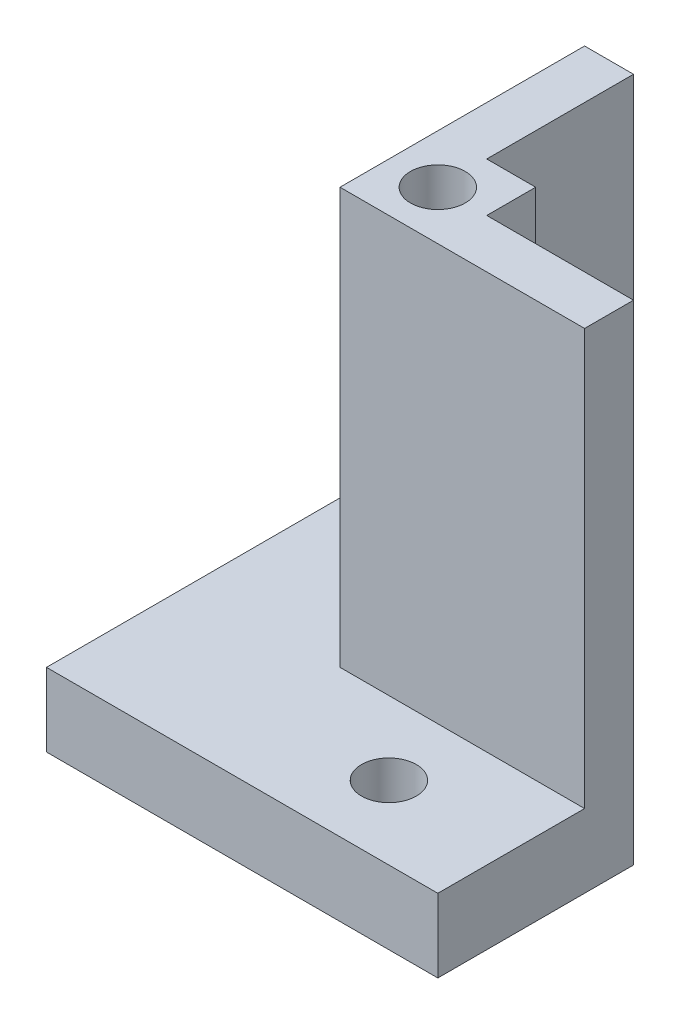
ISO-10303-21;
HEADER;
FILE_DESCRIPTION(('STEP AP214'),'2;1');
FILE_NAME('part.step','',(''),(''),'','','');
FILE_SCHEMA(('AUTOMOTIVE_DESIGN { 1 0 10303 214 1 1 1 1 }'));
ENDSEC;
DATA;
#1=APPLICATION_CONTEXT('core data for automotive mechanical design processes');
#2=APPLICATION_PROTOCOL_DEFINITION('international standard','automotive_design',2000,#1);
#3=PRODUCT_CONTEXT('',#1,'mechanical');
#4=PRODUCT('Part','Part','',(#3));
#5=PRODUCT_RELATED_PRODUCT_CATEGORY('part','',(#4));
#6=PRODUCT_DEFINITION_FORMATION('','',#4);
#7=PRODUCT_DEFINITION_CONTEXT('part definition',#1,'design');
#8=PRODUCT_DEFINITION('design','',#6,#7);
#9=PRODUCT_DEFINITION_SHAPE('','',#8);
#10=(LENGTH_UNIT() NAMED_UNIT(*) SI_UNIT(.MILLI.,.METRE.));
#11=(NAMED_UNIT(*) PLANE_ANGLE_UNIT() SI_UNIT($,.RADIAN.));
#12=(NAMED_UNIT(*) SI_UNIT($,.STERADIAN.) SOLID_ANGLE_UNIT());
#13=UNCERTAINTY_MEASURE_WITH_UNIT(LENGTH_MEASURE(1.E-05),#10,'distance_accuracy_value','');
#14=(GEOMETRIC_REPRESENTATION_CONTEXT(3) GLOBAL_UNCERTAINTY_ASSIGNED_CONTEXT((#13)) GLOBAL_UNIT_ASSIGNED_CONTEXT((#10,
#11,#12)) REPRESENTATION_CONTEXT('',''));
#15=CARTESIAN_POINT('',(0.,0.,0.));
#16=DIRECTION('',(0.,0.,1.));
#17=DIRECTION('',(1.,0.,0.));
#18=AXIS2_PLACEMENT_3D('',#15,#16,#17);
#19=CARTESIAN_POINT('',(-2.7325052631579,25.4,2.59079999999999));
#20=DIRECTION('',(1.,0.,0.));
#21=DIRECTION('',(0.,0.,-1.));
#22=AXIS2_PLACEMENT_3D('',#19,#20,#21);
#23=PLANE('',#22);
#24=DIRECTION('',(0.,0.,1.));
#25=VECTOR('',#24,1.);
#26=CARTESIAN_POINT('',(-2.7325052631579,3.81,2.59079999999999));
#27=LINE('',#26,#25);
#28=CARTESIAN_POINT('',(-2.7325052631579,3.81,-10.1092));
#29=VERTEX_POINT('',#28);
#30=CARTESIAN_POINT('',(-2.7325052631579,3.81,2.59079999999999));
#31=VERTEX_POINT('',#30);
#32=EDGE_CURVE('E58',#29,#31,#27,.T.);
#33=ORIENTED_EDGE('',*,*,#32,.T.);
#34=DIRECTION('',(0.,-1.,0.));
#35=VECTOR('',#34,1.);
#36=CARTESIAN_POINT('',(-2.7325052631579,25.4,2.59079999999999));
#37=LINE('',#36,#35);
#38=CARTESIAN_POINT('',(-2.7325052631579,25.4,2.59079999999999));
#39=VERTEX_POINT('',#38);
#40=EDGE_CURVE('E48',#39,#31,#37,.T.);
#41=ORIENTED_EDGE('',*,*,#40,.F.);
#42=DIRECTION('',(0.,0.,1.));
#43=VECTOR('',#42,1.);
#44=CARTESIAN_POINT('',(-2.7325052631579,25.4,-2.48920000000001));
#45=LINE('',#44,#43);
#46=CARTESIAN_POINT('',(-2.7325052631579,25.4,-10.1092));
#47=VERTEX_POINT('',#46);
#48=EDGE_CURVE('E189',#47,#39,#45,.T.);
#49=ORIENTED_EDGE('',*,*,#48,.F.);
#50=DIRECTION('',(0.,-1.,0.));
#51=VECTOR('',#50,1.);
#52=CARTESIAN_POINT('',(-2.7325052631579,25.4,-10.1092));
#53=LINE('',#52,#51);
#54=EDGE_CURVE('E11',#47,#29,#53,.T.);
#55=ORIENTED_EDGE('',*,*,#54,.T.);
#56=EDGE_LOOP('',(#33,#41,#49,#55));
#57=FACE_BOUND('',#56,.T.);
#58=ADVANCED_FACE('F39',(#57),#23,.F.);
#59=CARTESIAN_POINT('',(2.3474947368421,25.4,2.59079999999999));
#60=DIRECTION('',(0.,0.,-1.));
#61=DIRECTION('',(-1.,0.,0.));
#62=AXIS2_PLACEMENT_3D('',#59,#60,#61);
#63=PLANE('',#62);
#64=DIRECTION('',(1.,0.,0.));
#65=VECTOR('',#64,1.);
#66=CARTESIAN_POINT('',(9.9674947368421,3.81,2.59079999999999));
#67=LINE('',#66,#65);
#68=CARTESIAN_POINT('',(9.9674947368421,3.81,2.59079999999999));
#69=VERTEX_POINT('',#68);
#70=EDGE_CURVE('E150',#31,#69,#67,.T.);
#71=ORIENTED_EDGE('',*,*,#70,.T.);
#72=DIRECTION('',(0.,-1.,0.));
#73=VECTOR('',#72,1.);
#74=CARTESIAN_POINT('',(9.9674947368421,25.4,2.59079999999999));
#75=LINE('',#74,#73);
#76=CARTESIAN_POINT('',(9.9674947368421,25.4,2.59079999999999));
#77=VERTEX_POINT('',#76);
#78=EDGE_CURVE('E148',#77,#69,#75,.T.);
#79=ORIENTED_EDGE('',*,*,#78,.F.);
#80=DIRECTION('',(1.,0.,0.));
#81=VECTOR('',#80,1.);
#82=CARTESIAN_POINT('',(-2.7325052631579,25.4,2.59079999999999));
#83=LINE('',#82,#81);
#84=EDGE_CURVE('E193',#39,#77,#83,.T.);
#85=ORIENTED_EDGE('',*,*,#84,.F.);
#86=ORIENTED_EDGE('',*,*,#40,.T.);
#87=EDGE_LOOP('',(#71,#79,#85,#86));
#88=FACE_BOUND('',#87,.T.);
#89=ADVANCED_FACE('F251',(#88),#63,.F.);
#90=CARTESIAN_POINT('',(-2.7325052631579,25.4,-10.1092));
#91=DIRECTION('',(0.,0.,1.));
#92=DIRECTION('',(1.,0.,0.));
#93=AXIS2_PLACEMENT_3D('',#90,#91,#92);
#94=PLANE('',#93);
#95=DIRECTION('',(-1.,0.,0.));
#96=VECTOR('',#95,1.);
#97=CARTESIAN_POINT('',(-2.7325052631579,0.,-10.1092));
#98=LINE('',#97,#96);
#99=CARTESIAN_POINT('',(-0.192505263157901,0.,-10.1092));
#100=VERTEX_POINT('',#99);
#101=CARTESIAN_POINT('',(-10.3525052631579,0.,-10.1092));
#102=VERTEX_POINT('',#101);
#103=EDGE_CURVE('E181',#100,#102,#98,.T.);
#104=ORIENTED_EDGE('',*,*,#103,.T.);
#105=DIRECTION('',(0.,-1.,0.));
#106=VECTOR('',#105,1.);
#107=CARTESIAN_POINT('',(-10.3525052631579,3.81,-10.1092));
#108=LINE('',#107,#106);
#109=CARTESIAN_POINT('',(-10.3525052631579,3.81,-10.1092));
#110=VERTEX_POINT('',#109);
#111=EDGE_CURVE('E170',#110,#102,#108,.T.);
#112=ORIENTED_EDGE('',*,*,#111,.F.);
#113=DIRECTION('',(1.,0.,0.));
#114=VECTOR('',#113,1.);
#115=CARTESIAN_POINT('',(-10.3525052631579,3.81,-10.1092));
#116=LINE('',#115,#114);
#117=EDGE_CURVE('E159',#110,#29,#116,.T.);
#118=ORIENTED_EDGE('',*,*,#117,.T.);
#119=ORIENTED_EDGE('',*,*,#54,.F.);
#120=DIRECTION('',(-1.,0.,0.));
#121=VECTOR('',#120,1.);
#122=CARTESIAN_POINT('',(-2.7325052631579,25.4,-10.1092));
#123=LINE('',#122,#121);
#124=CARTESIAN_POINT('',(-0.192505263157901,25.4,-10.1092));
#125=VERTEX_POINT('',#124);
#126=EDGE_CURVE('E185',#125,#47,#123,.T.);
#127=ORIENTED_EDGE('',*,*,#126,.F.);
#128=DIRECTION('',(0.,-1.,0.));
#129=VECTOR('',#128,1.);
#130=CARTESIAN_POINT('',(-0.192505263157901,25.4,-10.1092));
#131=LINE('',#130,#129);
#132=EDGE_CURVE('E211',#125,#100,#131,.T.);
#133=ORIENTED_EDGE('',*,*,#132,.T.);
#134=EDGE_LOOP('',(#104,#112,#118,#119,#127,#133));
#135=FACE_BOUND('',#134,.T.);
#136=ADVANCED_FACE('F41',(#135),#94,.F.);
#137=CARTESIAN_POINT('',(9.9674947368421,25.4,2.59079999999999));
#138=DIRECTION('',(-1.,0.,0.));
#139=DIRECTION('',(0.,0.,1.));
#140=AXIS2_PLACEMENT_3D('',#137,#138,#139);
#141=PLANE('',#140);
#142=DIRECTION('',(0.,0.,-1.));
#143=VECTOR('',#142,1.);
#144=CARTESIAN_POINT('',(9.9674947368421,0.,2.59079999999999));
#145=LINE('',#144,#143);
#146=CARTESIAN_POINT('',(9.9674947368421,0.,10.2108));
#147=VERTEX_POINT('',#146);
#148=CARTESIAN_POINT('',(9.9674947368421,0.,0.0507999999999915));
#149=VERTEX_POINT('',#148);
#150=EDGE_CURVE('E214',#147,#149,#145,.T.);
#151=ORIENTED_EDGE('',*,*,#150,.T.);
#152=DIRECTION('',(0.,-1.,0.));
#153=VECTOR('',#152,1.);
#154=CARTESIAN_POINT('',(9.9674947368421,25.4,0.0507999999999915));
#155=LINE('',#154,#153);
#156=CARTESIAN_POINT('',(9.9674947368421,25.4,0.0507999999999915));
#157=VERTEX_POINT('',#156);
#158=EDGE_CURVE('E243',#157,#149,#155,.T.);
#159=ORIENTED_EDGE('',*,*,#158,.F.);
#160=DIRECTION('',(0.,0.,-1.));
#161=VECTOR('',#160,1.);
#162=CARTESIAN_POINT('',(9.9674947368421,25.4,2.59079999999999));
#163=LINE('',#162,#161);
#164=EDGE_CURVE('E196',#77,#157,#163,.T.);
#165=ORIENTED_EDGE('',*,*,#164,.F.);
#166=ORIENTED_EDGE('',*,*,#78,.T.);
#167=DIRECTION('',(0.,0.,1.));
#168=VECTOR('',#167,1.);
#169=CARTESIAN_POINT('',(9.9674947368421,3.81,2.59079999999999));
#170=LINE('',#169,#168);
#171=CARTESIAN_POINT('',(9.9674947368421,3.81,10.2108));
#172=VERTEX_POINT('',#171);
#173=EDGE_CURVE('E138',#69,#172,#170,.T.);
#174=ORIENTED_EDGE('',*,*,#173,.T.);
#175=DIRECTION('',(0.,-1.,0.));
#176=VECTOR('',#175,1.);
#177=CARTESIAN_POINT('',(9.9674947368421,3.81,10.2108));
#178=LINE('',#177,#176);
#179=EDGE_CURVE('E122',#172,#147,#178,.T.);
#180=ORIENTED_EDGE('',*,*,#179,.T.);
#181=EDGE_LOOP('',(#151,#159,#165,#166,#174,#180));
#182=FACE_BOUND('',#181,.T.);
#183=ADVANCED_FACE('F145',(#182),#141,.F.);
#184=CARTESIAN_POINT('',(9.9674947368421,25.4,0.0507999999999915));
#185=DIRECTION('',(0.,0.,1.));
#186=DIRECTION('',(1.,0.,0.));
#187=AXIS2_PLACEMENT_3D('',#184,#185,#186);
#188=PLANE('',#187);
#189=DIRECTION('',(-1.,0.,0.));
#190=VECTOR('',#189,1.);
#191=CARTESIAN_POINT('',(9.9674947368421,0.,0.0507999999999915));
#192=LINE('',#191,#190);
#193=CARTESIAN_POINT('',(2.3474947368421,0.,0.0507999999999906));
#194=VERTEX_POINT('',#193);
#195=EDGE_CURVE('E217',#149,#194,#192,.T.);
#196=ORIENTED_EDGE('',*,*,#195,.T.);
#197=DIRECTION('',(0.,-1.,0.));
#198=VECTOR('',#197,1.);
#199=CARTESIAN_POINT('',(2.3474947368421,25.4,0.0507999999999906));
#200=LINE('',#199,#198);
#201=CARTESIAN_POINT('',(2.3474947368421,25.4,0.0507999999999906));
#202=VERTEX_POINT('',#201);
#203=EDGE_CURVE('E239',#202,#194,#200,.T.);
#204=ORIENTED_EDGE('',*,*,#203,.F.);
#205=DIRECTION('',(-1.,0.,0.));
#206=VECTOR('',#205,1.);
#207=CARTESIAN_POINT('',(9.9674947368421,25.4,0.0507999999999915));
#208=LINE('',#207,#206);
#209=EDGE_CURVE('E199',#157,#202,#208,.T.);
#210=ORIENTED_EDGE('',*,*,#209,.F.);
#211=ORIENTED_EDGE('',*,*,#158,.T.);
#212=EDGE_LOOP('',(#196,#204,#210,#211));
#213=FACE_BOUND('',#212,.T.);
#214=ADVANCED_FACE('F264',(#213),#188,.F.);
#215=CARTESIAN_POINT('',(2.3474947368421,25.4,0.0507999999999906));
#216=DIRECTION('',(-1.,0.,0.));
#217=DIRECTION('',(0.,0.,1.));
#218=AXIS2_PLACEMENT_3D('',#215,#216,#217);
#219=PLANE('',#218);
#220=DIRECTION('',(0.,0.,-1.));
#221=VECTOR('',#220,1.);
#222=CARTESIAN_POINT('',(2.3474947368421,0.,0.0507999999999906));
#223=LINE('',#222,#221);
#224=CARTESIAN_POINT('',(2.3474947368421,0.,-2.48920000000001));
#225=VERTEX_POINT('',#224);
#226=EDGE_CURVE('E220',#194,#225,#223,.T.);
#227=ORIENTED_EDGE('',*,*,#226,.T.);
#228=DIRECTION('',(0.,-1.,0.));
#229=VECTOR('',#228,1.);
#230=CARTESIAN_POINT('',(2.3474947368421,25.4,-2.48920000000001));
#231=LINE('',#230,#229);
#232=CARTESIAN_POINT('',(2.3474947368421,25.4,-2.48920000000001));
#233=VERTEX_POINT('',#232);
#234=EDGE_CURVE('E235',#233,#225,#231,.T.);
#235=ORIENTED_EDGE('',*,*,#234,.F.);
#236=DIRECTION('',(0.,0.,-1.));
#237=VECTOR('',#236,1.);
#238=CARTESIAN_POINT('',(2.3474947368421,25.4,0.0507999999999906));
#239=LINE('',#238,#237);
#240=EDGE_CURVE('E202',#202,#233,#239,.T.);
#241=ORIENTED_EDGE('',*,*,#240,.F.);
#242=ORIENTED_EDGE('',*,*,#203,.T.);
#243=EDGE_LOOP('',(#227,#235,#241,#242));
#244=FACE_BOUND('',#243,.T.);
#245=ADVANCED_FACE('F281',(#244),#219,.F.);
#246=CARTESIAN_POINT('',(-0.192505263157901,25.4,-2.48920000000001));
#247=DIRECTION('',(0.,0.,1.));
#248=DIRECTION('',(1.,0.,0.));
#249=AXIS2_PLACEMENT_3D('',#246,#247,#248);
#250=PLANE('',#249);
#251=DIRECTION('',(-1.,0.,0.));
#252=VECTOR('',#251,1.);
#253=CARTESIAN_POINT('',(-0.192505263157901,0.,-2.48920000000001));
#254=LINE('',#253,#252);
#255=CARTESIAN_POINT('',(-0.192505263157901,0.,-2.48920000000001));
#256=VERTEX_POINT('',#255);
#257=EDGE_CURVE('E223',#225,#256,#254,.T.);
#258=ORIENTED_EDGE('',*,*,#257,.T.);
#259=DIRECTION('',(0.,-1.,0.));
#260=VECTOR('',#259,1.);
#261=CARTESIAN_POINT('',(-0.192505263157901,25.4,-2.48920000000001));
#262=LINE('',#261,#260);
#263=CARTESIAN_POINT('',(-0.192505263157901,25.4,-2.48920000000001));
#264=VERTEX_POINT('',#263);
#265=EDGE_CURVE('E231',#264,#256,#262,.T.);
#266=ORIENTED_EDGE('',*,*,#265,.F.);
#267=DIRECTION('',(-1.,0.,0.));
#268=VECTOR('',#267,1.);
#269=CARTESIAN_POINT('',(-0.192505263157901,25.4,-2.48920000000001));
#270=LINE('',#269,#268);
#271=EDGE_CURVE('E205',#233,#264,#270,.T.);
#272=ORIENTED_EDGE('',*,*,#271,.F.);
#273=ORIENTED_EDGE('',*,*,#234,.T.);
#274=EDGE_LOOP('',(#258,#266,#272,#273));
#275=FACE_BOUND('',#274,.T.);
#276=ADVANCED_FACE('F284',(#275),#250,.F.);
#277=CARTESIAN_POINT('',(-0.192505263157901,25.4,-10.1092));
#278=DIRECTION('',(-1.,0.,0.));
#279=DIRECTION('',(0.,0.,1.));
#280=AXIS2_PLACEMENT_3D('',#277,#278,#279);
#281=PLANE('',#280);
#282=DIRECTION('',(0.,0.,-1.));
#283=VECTOR('',#282,1.);
#284=CARTESIAN_POINT('',(-0.192505263157901,0.,-10.1092));
#285=LINE('',#284,#283);
#286=EDGE_CURVE('E190',#256,#100,#285,.T.);
#287=ORIENTED_EDGE('',*,*,#286,.T.);
#288=ORIENTED_EDGE('',*,*,#132,.F.);
#289=DIRECTION('',(0.,0.,-1.));
#290=VECTOR('',#289,1.);
#291=CARTESIAN_POINT('',(-0.192505263157901,25.4,-10.1092));
#292=LINE('',#291,#290);
#293=EDGE_CURVE('E208',#264,#125,#292,.T.);
#294=ORIENTED_EDGE('',*,*,#293,.F.);
#295=ORIENTED_EDGE('',*,*,#265,.T.);
#296=EDGE_LOOP('',(#287,#288,#294,#295));
#297=FACE_BOUND('',#296,.T.);
#298=ADVANCED_FACE('F288',(#297),#281,.F.);
#299=CARTESIAN_POINT('',(0.,25.4,0.));
#300=DIRECTION('',(0.,-1.,0.));
#301=DIRECTION('',(0.,0.,-1.));
#302=AXIS2_PLACEMENT_3D('',#299,#300,#301);
#303=PLANE('',#302);
#304=CARTESIAN_POINT('',(-0.192505263157902,25.4,0.0507999999999932));
#305=DIRECTION('',(0.,1.,0.));
#306=DIRECTION('',(0.,0.,1.));
#307=AXIS2_PLACEMENT_3D('',#304,#305,#306);
#308=CIRCLE('',#307,1.4224);
#309=CARTESIAN_POINT('',(-0.192505263157902,25.4,1.47319999999999));
#310=VERTEX_POINT('',#309);
#311=EDGE_CURVE('E174',#310,#310,#308,.T.);
#312=ORIENTED_EDGE('',*,*,#311,.F.);
#313=EDGE_LOOP('',(#312));
#314=FACE_BOUND('',#313,.T.);
#315=ORIENTED_EDGE('',*,*,#126,.T.);
#316=ORIENTED_EDGE('',*,*,#48,.T.);
#317=ORIENTED_EDGE('',*,*,#84,.T.);
#318=ORIENTED_EDGE('',*,*,#164,.T.);
#319=ORIENTED_EDGE('',*,*,#209,.T.);
#320=ORIENTED_EDGE('',*,*,#240,.T.);
#321=ORIENTED_EDGE('',*,*,#271,.T.);
#322=ORIENTED_EDGE('',*,*,#293,.T.);
#323=EDGE_LOOP('',(#315,#316,#317,#318,#319,#320,#321,#322));
#324=FACE_BOUND('',#323,.T.);
#325=ADVANCED_FACE('F268',(#314,#324),#303,.F.);
#326=CARTESIAN_POINT('',(0.,0.,0.));
#327=DIRECTION('',(0.,-1.,0.));
#328=DIRECTION('',(0.,0.,-1.));
#329=AXIS2_PLACEMENT_3D('',#326,#327,#328);
#330=PLANE('',#329);
#331=CARTESIAN_POINT('',(-6.5425052631579,0.,-3.75920000000001));
#332=DIRECTION('',(0.,1.,0.));
#333=DIRECTION('',(0.,0.,1.));
#334=AXIS2_PLACEMENT_3D('',#331,#332,#333);
#335=CIRCLE('',#334,1.4224);
#336=CARTESIAN_POINT('',(-6.5425052631579,0.,-2.33680000000001));
#337=VERTEX_POINT('',#336);
#338=EDGE_CURVE('E166',#337,#337,#335,.T.);
#339=ORIENTED_EDGE('',*,*,#338,.T.);
#340=EDGE_LOOP('',(#339));
#341=FACE_BOUND('',#340,.T.);
#342=CARTESIAN_POINT('',(3.6174947368421,0.,6.40079999999999));
#343=DIRECTION('',(0.,1.,0.));
#344=DIRECTION('',(0.,0.,1.));
#345=AXIS2_PLACEMENT_3D('',#342,#343,#344);
#346=CIRCLE('',#345,1.4224);
#347=CARTESIAN_POINT('',(3.6174947368421,0.,7.8232));
#348=VERTEX_POINT('',#347);
#349=EDGE_CURVE('E336',#348,#348,#346,.T.);
#350=ORIENTED_EDGE('',*,*,#349,.T.);
#351=EDGE_LOOP('',(#350));
#352=FACE_BOUND('',#351,.T.);
#353=ORIENTED_EDGE('',*,*,#150,.F.);
#354=DIRECTION('',(-1.,0.,0.));
#355=VECTOR('',#354,1.);
#356=CARTESIAN_POINT('',(9.9674947368421,0.,10.2108));
#357=LINE('',#356,#355);
#358=CARTESIAN_POINT('',(-10.3525052631579,0.,10.2108));
#359=VERTEX_POINT('',#358);
#360=EDGE_CURVE('E127',#147,#359,#357,.T.);
#361=ORIENTED_EDGE('',*,*,#360,.T.);
#362=DIRECTION('',(0.,0.,-1.));
#363=VECTOR('',#362,1.);
#364=CARTESIAN_POINT('',(-10.3525052631579,0.,10.2108));
#365=LINE('',#364,#363);
#366=EDGE_CURVE('E153',#359,#102,#365,.T.);
#367=ORIENTED_EDGE('',*,*,#366,.T.);
#368=ORIENTED_EDGE('',*,*,#103,.F.);
#369=ORIENTED_EDGE('',*,*,#286,.F.);
#370=ORIENTED_EDGE('',*,*,#257,.F.);
#371=ORIENTED_EDGE('',*,*,#226,.F.);
#372=ORIENTED_EDGE('',*,*,#195,.F.);
#373=EDGE_LOOP('',(#353,#361,#367,#368,#369,#370,#371,#372));
#374=FACE_BOUND('',#373,.T.);
#375=ADVANCED_FACE('F258',(#341,#352,#374),#330,.T.);
#376=CARTESIAN_POINT('',(-0.192505263157902,21.59,0.0507999999999932));
#377=DIRECTION('',(0.,1.,0.));
#378=DIRECTION('',(0.,0.,1.));
#379=AXIS2_PLACEMENT_3D('',#376,#377,#378);
#380=CYLINDRICAL_SURFACE('',#379,1.4224);
#381=CARTESIAN_POINT('',(-0.192505263157902,21.59,0.0507999999999932));
#382=DIRECTION('',(0.,1.,0.));
#383=DIRECTION('',(0.,0.,1.));
#384=AXIS2_PLACEMENT_3D('',#381,#382,#383);
#385=CIRCLE('',#384,1.4224);
#386=CARTESIAN_POINT('',(-0.192505263157902,21.59,1.47319999999999));
#387=VERTEX_POINT('',#386);
#388=EDGE_CURVE('E177',#387,#387,#385,.T.);
#389=ORIENTED_EDGE('',*,*,#388,.F.);
#390=EDGE_LOOP('',(#389));
#391=FACE_BOUND('',#390,.T.);
#392=ORIENTED_EDGE('',*,*,#311,.T.);
#393=EDGE_LOOP('',(#392));
#394=FACE_BOUND('',#393,.T.);
#395=ADVANCED_FACE('F295',(#391,#394),#380,.F.);
#396=CARTESIAN_POINT('',(-0.192505263157902,21.59,0.0507999999999932));
#397=DIRECTION('',(0.,1.,0.));
#398=DIRECTION('',(0.,0.,1.));
#399=AXIS2_PLACEMENT_3D('',#396,#397,#398);
#400=PLANE('',#399);
#401=ORIENTED_EDGE('',*,*,#388,.T.);
#402=EDGE_LOOP('',(#401));
#403=FACE_BOUND('',#402,.T.);
#404=ADVANCED_FACE('F302',(#403),#400,.T.);
#405=CARTESIAN_POINT('',(-10.3525052631579,3.81,10.2108));
#406=DIRECTION('',(-1.,0.,0.));
#407=DIRECTION('',(0.,0.,1.));
#408=AXIS2_PLACEMENT_3D('',#405,#406,#407);
#409=PLANE('',#408);
#410=ORIENTED_EDGE('',*,*,#366,.F.);
#411=DIRECTION('',(0.,-1.,0.));
#412=VECTOR('',#411,1.);
#413=CARTESIAN_POINT('',(-10.3525052631579,3.81,10.2108));
#414=LINE('',#413,#412);
#415=CARTESIAN_POINT('',(-10.3525052631579,3.81,10.2108));
#416=VERTEX_POINT('',#415);
#417=EDGE_CURVE('E131',#416,#359,#414,.T.);
#418=ORIENTED_EDGE('',*,*,#417,.F.);
#419=DIRECTION('',(0.,0.,-1.));
#420=VECTOR('',#419,1.);
#421=CARTESIAN_POINT('',(-10.3525052631579,3.81,10.2108));
#422=LINE('',#421,#420);
#423=EDGE_CURVE('E141',#416,#110,#422,.T.);
#424=ORIENTED_EDGE('',*,*,#423,.T.);
#425=ORIENTED_EDGE('',*,*,#111,.T.);
#426=EDGE_LOOP('',(#410,#418,#424,#425));
#427=FACE_BOUND('',#426,.T.);
#428=ADVANCED_FACE('F255',(#427),#409,.T.);
#429=CARTESIAN_POINT('',(9.9674947368421,3.81,10.2108));
#430=DIRECTION('',(0.,0.,1.));
#431=DIRECTION('',(1.,0.,0.));
#432=AXIS2_PLACEMENT_3D('',#429,#430,#431);
#433=PLANE('',#432);
#434=ORIENTED_EDGE('',*,*,#360,.F.);
#435=ORIENTED_EDGE('',*,*,#179,.F.);
#436=DIRECTION('',(-1.,0.,0.));
#437=VECTOR('',#436,1.);
#438=CARTESIAN_POINT('',(9.9674947368421,3.81,10.2108));
#439=LINE('',#438,#437);
#440=EDGE_CURVE('E125',#172,#416,#439,.T.);
#441=ORIENTED_EDGE('',*,*,#440,.T.);
#442=ORIENTED_EDGE('',*,*,#417,.T.);
#443=EDGE_LOOP('',(#434,#435,#441,#442));
#444=FACE_BOUND('',#443,.T.);
#445=ADVANCED_FACE('F124',(#444),#433,.T.);
#446=CARTESIAN_POINT('',(0.,3.81,0.));
#447=DIRECTION('',(0.,-1.,0.));
#448=DIRECTION('',(0.,0.,-1.));
#449=AXIS2_PLACEMENT_3D('',#446,#447,#448);
#450=PLANE('',#449);
#451=CARTESIAN_POINT('',(-6.5425052631579,3.81,-3.75920000000001));
#452=DIRECTION('',(0.,1.,0.));
#453=DIRECTION('',(0.,0.,1.));
#454=AXIS2_PLACEMENT_3D('',#451,#452,#453);
#455=CIRCLE('',#454,1.4224);
#456=CARTESIAN_POINT('',(-6.5425052631579,3.81,-2.33680000000001));
#457=VERTEX_POINT('',#456);
#458=EDGE_CURVE('E328',#457,#457,#455,.T.);
#459=ORIENTED_EDGE('',*,*,#458,.F.);
#460=EDGE_LOOP('',(#459));
#461=FACE_BOUND('',#460,.T.);
#462=CARTESIAN_POINT('',(3.6174947368421,3.81,6.40079999999999));
#463=DIRECTION('',(0.,1.,0.));
#464=DIRECTION('',(0.,0.,1.));
#465=AXIS2_PLACEMENT_3D('',#462,#463,#464);
#466=CIRCLE('',#465,1.4224);
#467=CARTESIAN_POINT('',(3.6174947368421,3.81,7.8232));
#468=VERTEX_POINT('',#467);
#469=EDGE_CURVE('E330',#468,#468,#466,.T.);
#470=ORIENTED_EDGE('',*,*,#469,.F.);
#471=EDGE_LOOP('',(#470));
#472=FACE_BOUND('',#471,.T.);
#473=ORIENTED_EDGE('',*,*,#70,.F.);
#474=ORIENTED_EDGE('',*,*,#32,.F.);
#475=ORIENTED_EDGE('',*,*,#117,.F.);
#476=ORIENTED_EDGE('',*,*,#423,.F.);
#477=ORIENTED_EDGE('',*,*,#440,.F.);
#478=ORIENTED_EDGE('',*,*,#173,.F.);
#479=EDGE_LOOP('',(#473,#474,#475,#476,#477,#478));
#480=FACE_BOUND('',#479,.T.);
#481=ADVANCED_FACE('F137',(#461,#472,#480),#450,.F.);
#482=CARTESIAN_POINT('',(3.6174947368421,0.,6.40079999999999));
#483=DIRECTION('',(0.,1.,0.));
#484=DIRECTION('',(0.,0.,1.));
#485=AXIS2_PLACEMENT_3D('',#482,#483,#484);
#486=CYLINDRICAL_SURFACE('',#485,1.4224);
#487=ORIENTED_EDGE('',*,*,#349,.F.);
#488=EDGE_LOOP('',(#487));
#489=FACE_BOUND('',#488,.T.);
#490=ORIENTED_EDGE('',*,*,#469,.T.);
#491=EDGE_LOOP('',(#490));
#492=FACE_BOUND('',#491,.T.);
#493=ADVANCED_FACE('F313',(#489,#492),#486,.F.);
#494=CARTESIAN_POINT('',(-6.5425052631579,0.,-3.75920000000001));
#495=DIRECTION('',(0.,1.,0.));
#496=DIRECTION('',(0.,0.,1.));
#497=AXIS2_PLACEMENT_3D('',#494,#495,#496);
#498=CYLINDRICAL_SURFACE('',#497,1.4224);
#499=ORIENTED_EDGE('',*,*,#338,.F.);
#500=EDGE_LOOP('',(#499));
#501=FACE_BOUND('',#500,.T.);
#502=ORIENTED_EDGE('',*,*,#458,.T.);
#503=EDGE_LOOP('',(#502));
#504=FACE_BOUND('',#503,.T.);
#505=ADVANCED_FACE('F317',(#501,#504),#498,.F.);
#506=CLOSED_SHELL('',(#58,#89,#136,#183,#214,#245,#276,#298,#325,#375,#395,#404,#428,#445,#481,
#493,#505));
#507=MANIFOLD_SOLID_BREP('B2',#506);
#508=ADVANCED_BREP_SHAPE_REPRESENTATION('',(#18,#507),#14);
#509=SHAPE_DEFINITION_REPRESENTATION(#9,#508);
ENDSEC;
END-ISO-10303-21;
